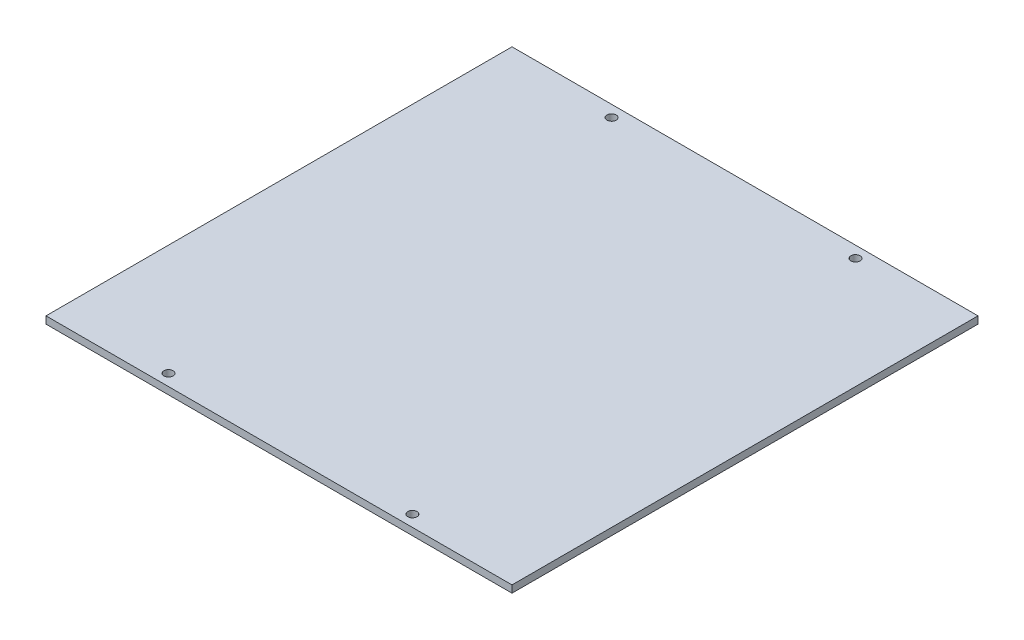
ISO-10303-21;
HEADER;
FILE_DESCRIPTION(('STEP AP214'),'2;1');
FILE_NAME('part.step','',(''),(''),'','','');
FILE_SCHEMA(('AUTOMOTIVE_DESIGN { 1 0 10303 214 1 1 1 1 }'));
ENDSEC;
DATA;
#1=APPLICATION_CONTEXT('core data for automotive mechanical design processes');
#2=APPLICATION_PROTOCOL_DEFINITION('international standard','automotive_design',2000,#1);
#3=PRODUCT_CONTEXT('',#1,'mechanical');
#4=PRODUCT('Part','Part','',(#3));
#5=PRODUCT_RELATED_PRODUCT_CATEGORY('part','',(#4));
#6=PRODUCT_DEFINITION_FORMATION('','',#4);
#7=PRODUCT_DEFINITION_CONTEXT('part definition',#1,'design');
#8=PRODUCT_DEFINITION('design','',#6,#7);
#9=PRODUCT_DEFINITION_SHAPE('','',#8);
#10=(LENGTH_UNIT() NAMED_UNIT(*) SI_UNIT(.MILLI.,.METRE.));
#11=(NAMED_UNIT(*) PLANE_ANGLE_UNIT() SI_UNIT($,.RADIAN.));
#12=(NAMED_UNIT(*) SI_UNIT($,.STERADIAN.) SOLID_ANGLE_UNIT());
#13=UNCERTAINTY_MEASURE_WITH_UNIT(LENGTH_MEASURE(1.E-05),#10,'distance_accuracy_value','');
#14=(GEOMETRIC_REPRESENTATION_CONTEXT(3) GLOBAL_UNCERTAINTY_ASSIGNED_CONTEXT((#13)) GLOBAL_UNIT_ASSIGNED_CONTEXT((#10,
#11,#12)) REPRESENTATION_CONTEXT('',''));
#15=CARTESIAN_POINT('',(0.,0.,0.));
#16=DIRECTION('',(0.,0.,1.));
#17=DIRECTION('',(1.,0.,0.));
#18=AXIS2_PLACEMENT_3D('',#15,#16,#17);
#19=CARTESIAN_POINT('',(0.,1.57,0.));
#20=DIRECTION('',(0.,1.,0.));
#21=DIRECTION('',(0.,0.,1.));
#22=AXIS2_PLACEMENT_3D('',#19,#20,#21);
#23=PLANE('',#22);
#24=CARTESIAN_POINT('',(26.5875,1.57,-48.3));
#25=DIRECTION('',(0.,1.,0.));
#26=DIRECTION('',(0.,0.,1.));
#27=AXIS2_PLACEMENT_3D('',#24,#25,#26);
#28=CIRCLE('',#27,1.);
#29=CARTESIAN_POINT('',(26.5875,1.57,-47.3));
#30=VERTEX_POINT('',#29);
#31=EDGE_CURVE('E123',#30,#30,#28,.T.);
#32=ORIENTED_EDGE('',*,*,#31,.F.);
#33=EDGE_LOOP('',(#32));
#34=FACE_BOUND('',#33,.T.);
#35=CARTESIAN_POINT('',(-26.5875,1.57,48.3));
#36=DIRECTION('',(0.,1.,0.));
#37=DIRECTION('',(0.,0.,1.));
#38=AXIS2_PLACEMENT_3D('',#35,#36,#37);
#39=CIRCLE('',#38,1.);
#40=CARTESIAN_POINT('',(-26.5875,1.57,49.3));
#41=VERTEX_POINT('',#40);
#42=EDGE_CURVE('E102',#41,#41,#39,.T.);
#43=ORIENTED_EDGE('',*,*,#42,.F.);
#44=EDGE_LOOP('',(#43));
#45=FACE_BOUND('',#44,.T.);
#46=DIRECTION('',(0.,0.,1.));
#47=VECTOR('',#46,1.);
#48=CARTESIAN_POINT('',(-50.8,1.57,50.8));
#49=LINE('',#48,#47);
#50=CARTESIAN_POINT('',(-50.8,1.57,-50.8));
#51=VERTEX_POINT('',#50);
#52=CARTESIAN_POINT('',(-50.8,1.57,50.8));
#53=VERTEX_POINT('',#52);
#54=EDGE_CURVE('E87',#51,#53,#49,.T.);
#55=ORIENTED_EDGE('',*,*,#54,.T.);
#56=DIRECTION('',(1.,0.,0.));
#57=VECTOR('',#56,1.);
#58=CARTESIAN_POINT('',(50.8,1.57,50.8));
#59=LINE('',#58,#57);
#60=CARTESIAN_POINT('',(50.8,1.57,50.8));
#61=VERTEX_POINT('',#60);
#62=EDGE_CURVE('E82',#53,#61,#59,.T.);
#63=ORIENTED_EDGE('',*,*,#62,.T.);
#64=DIRECTION('',(0.,0.,-1.));
#65=VECTOR('',#64,1.);
#66=CARTESIAN_POINT('',(50.8,1.57,50.8));
#67=LINE('',#66,#65);
#68=CARTESIAN_POINT('',(50.8,1.57,-50.8));
#69=VERTEX_POINT('',#68);
#70=EDGE_CURVE('E85',#61,#69,#67,.T.);
#71=ORIENTED_EDGE('',*,*,#70,.T.);
#72=DIRECTION('',(-1.,0.,0.));
#73=VECTOR('',#72,1.);
#74=CARTESIAN_POINT('',(50.8,1.57,-50.8));
#75=LINE('',#74,#73);
#76=EDGE_CURVE('E52',#69,#51,#75,.T.);
#77=ORIENTED_EDGE('',*,*,#76,.T.);
#78=EDGE_LOOP('',(#55,#63,#71,#77));
#79=FACE_BOUND('',#78,.T.);
#80=CARTESIAN_POINT('',(-26.5875,1.57,-48.3));
#81=DIRECTION('',(0.,1.,0.));
#82=DIRECTION('',(0.,0.,1.));
#83=AXIS2_PLACEMENT_3D('',#80,#81,#82);
#84=CIRCLE('',#83,1.);
#85=CARTESIAN_POINT('',(-26.5875,1.57,-47.3));
#86=VERTEX_POINT('',#85);
#87=EDGE_CURVE('E117',#86,#86,#84,.T.);
#88=ORIENTED_EDGE('',*,*,#87,.F.);
#89=EDGE_LOOP('',(#88));
#90=FACE_BOUND('',#89,.T.);
#91=CARTESIAN_POINT('',(26.5875,1.57,48.3));
#92=DIRECTION('',(0.,1.,0.));
#93=DIRECTION('',(0.,0.,1.));
#94=AXIS2_PLACEMENT_3D('',#91,#92,#93);
#95=CIRCLE('',#94,1.);
#96=CARTESIAN_POINT('',(26.5875,1.57,49.3));
#97=VERTEX_POINT('',#96);
#98=EDGE_CURVE('E129',#97,#97,#95,.T.);
#99=ORIENTED_EDGE('',*,*,#98,.F.);
#100=EDGE_LOOP('',(#99));
#101=FACE_BOUND('',#100,.T.);
#102=ADVANCED_FACE('F35',(#34,#45,#79,#90,#101),#23,.T.);
#103=CARTESIAN_POINT('',(0.,0.,0.));
#104=DIRECTION('',(0.,1.,0.));
#105=DIRECTION('',(0.,0.,1.));
#106=AXIS2_PLACEMENT_3D('',#103,#104,#105);
#107=PLANE('',#106);
#108=DIRECTION('',(0.,0.,1.));
#109=VECTOR('',#108,1.);
#110=CARTESIAN_POINT('',(-50.8,0.,50.8));
#111=LINE('',#110,#109);
#112=CARTESIAN_POINT('',(-50.8,0.,-50.8));
#113=VERTEX_POINT('',#112);
#114=CARTESIAN_POINT('',(-50.8,0.,50.8));
#115=VERTEX_POINT('',#114);
#116=EDGE_CURVE('E99',#113,#115,#111,.T.);
#117=ORIENTED_EDGE('',*,*,#116,.F.);
#118=DIRECTION('',(-1.,0.,0.));
#119=VECTOR('',#118,1.);
#120=CARTESIAN_POINT('',(50.8,0.,-50.8));
#121=LINE('',#120,#119);
#122=CARTESIAN_POINT('',(50.8,0.,-50.8));
#123=VERTEX_POINT('',#122);
#124=EDGE_CURVE('E75',#123,#113,#121,.T.);
#125=ORIENTED_EDGE('',*,*,#124,.F.);
#126=DIRECTION('',(0.,0.,-1.));
#127=VECTOR('',#126,1.);
#128=CARTESIAN_POINT('',(50.8,0.,50.8));
#129=LINE('',#128,#127);
#130=CARTESIAN_POINT('',(50.8,0.,50.8));
#131=VERTEX_POINT('',#130);
#132=EDGE_CURVE('E69',#131,#123,#129,.T.);
#133=ORIENTED_EDGE('',*,*,#132,.F.);
#134=DIRECTION('',(1.,0.,0.));
#135=VECTOR('',#134,1.);
#136=CARTESIAN_POINT('',(50.8,0.,50.8));
#137=LINE('',#136,#135);
#138=EDGE_CURVE('E91',#115,#131,#137,.T.);
#139=ORIENTED_EDGE('',*,*,#138,.F.);
#140=EDGE_LOOP('',(#117,#125,#133,#139));
#141=FACE_BOUND('',#140,.T.);
#142=CARTESIAN_POINT('',(-26.5875,0.,48.3));
#143=DIRECTION('',(0.,1.,0.));
#144=DIRECTION('',(0.,0.,1.));
#145=AXIS2_PLACEMENT_3D('',#142,#143,#144);
#146=CIRCLE('',#145,1.);
#147=CARTESIAN_POINT('',(-26.5875,0.,49.3));
#148=VERTEX_POINT('',#147);
#149=EDGE_CURVE('E114',#148,#148,#146,.T.);
#150=ORIENTED_EDGE('',*,*,#149,.T.);
#151=EDGE_LOOP('',(#150));
#152=FACE_BOUND('',#151,.T.);
#153=CARTESIAN_POINT('',(-26.5875,0.,-48.3));
#154=DIRECTION('',(0.,1.,0.));
#155=DIRECTION('',(0.,0.,1.));
#156=AXIS2_PLACEMENT_3D('',#153,#154,#155);
#157=CIRCLE('',#156,1.);
#158=CARTESIAN_POINT('',(-26.5875,0.,-47.3));
#159=VERTEX_POINT('',#158);
#160=EDGE_CURVE('E120',#159,#159,#157,.T.);
#161=ORIENTED_EDGE('',*,*,#160,.T.);
#162=EDGE_LOOP('',(#161));
#163=FACE_BOUND('',#162,.T.);
#164=CARTESIAN_POINT('',(26.5875,0.,-48.3));
#165=DIRECTION('',(0.,1.,0.));
#166=DIRECTION('',(0.,0.,1.));
#167=AXIS2_PLACEMENT_3D('',#164,#165,#166);
#168=CIRCLE('',#167,1.);
#169=CARTESIAN_POINT('',(26.5875,0.,-47.3));
#170=VERTEX_POINT('',#169);
#171=EDGE_CURVE('E126',#170,#170,#168,.T.);
#172=ORIENTED_EDGE('',*,*,#171,.T.);
#173=EDGE_LOOP('',(#172));
#174=FACE_BOUND('',#173,.T.);
#175=CARTESIAN_POINT('',(26.5875,0.,48.3));
#176=DIRECTION('',(0.,1.,0.));
#177=DIRECTION('',(0.,0.,1.));
#178=AXIS2_PLACEMENT_3D('',#175,#176,#177);
#179=CIRCLE('',#178,1.);
#180=CARTESIAN_POINT('',(26.5875,0.,49.3));
#181=VERTEX_POINT('',#180);
#182=EDGE_CURVE('E132',#181,#181,#179,.T.);
#183=ORIENTED_EDGE('',*,*,#182,.T.);
#184=EDGE_LOOP('',(#183));
#185=FACE_BOUND('',#184,.T.);
#186=ADVANCED_FACE('F110',(#141,#152,#163,#174,#185),#107,.F.);
#187=CARTESIAN_POINT('',(-50.8,1.57,50.8));
#188=DIRECTION('',(1.,0.,0.));
#189=DIRECTION('',(0.,0.,-1.));
#190=AXIS2_PLACEMENT_3D('',#187,#188,#189);
#191=PLANE('',#190);
#192=ORIENTED_EDGE('',*,*,#116,.T.);
#193=DIRECTION('',(0.,-1.,0.));
#194=VECTOR('',#193,1.);
#195=CARTESIAN_POINT('',(-50.8,1.57,50.8));
#196=LINE('',#195,#194);
#197=EDGE_CURVE('E11',#53,#115,#196,.T.);
#198=ORIENTED_EDGE('',*,*,#197,.F.);
#199=ORIENTED_EDGE('',*,*,#54,.F.);
#200=DIRECTION('',(0.,-1.,0.));
#201=VECTOR('',#200,1.);
#202=CARTESIAN_POINT('',(-50.8,1.57,-50.8));
#203=LINE('',#202,#201);
#204=EDGE_CURVE('E95',#51,#113,#203,.T.);
#205=ORIENTED_EDGE('',*,*,#204,.T.);
#206=EDGE_LOOP('',(#192,#198,#199,#205));
#207=FACE_BOUND('',#206,.T.);
#208=ADVANCED_FACE('F37',(#207),#191,.F.);
#209=CARTESIAN_POINT('',(50.8,1.57,50.8));
#210=DIRECTION('',(0.,0.,-1.));
#211=DIRECTION('',(-1.,0.,0.));
#212=AXIS2_PLACEMENT_3D('',#209,#210,#211);
#213=PLANE('',#212);
#214=ORIENTED_EDGE('',*,*,#138,.T.);
#215=DIRECTION('',(0.,-1.,0.));
#216=VECTOR('',#215,1.);
#217=CARTESIAN_POINT('',(50.8,1.57,50.8));
#218=LINE('',#217,#216);
#219=EDGE_CURVE('E44',#61,#131,#218,.T.);
#220=ORIENTED_EDGE('',*,*,#219,.F.);
#221=ORIENTED_EDGE('',*,*,#62,.F.);
#222=ORIENTED_EDGE('',*,*,#197,.T.);
#223=EDGE_LOOP('',(#214,#220,#221,#222));
#224=FACE_BOUND('',#223,.T.);
#225=ADVANCED_FACE('F90',(#224),#213,.F.);
#226=CARTESIAN_POINT('',(50.8,1.57,50.8));
#227=DIRECTION('',(-1.,0.,0.));
#228=DIRECTION('',(0.,0.,1.));
#229=AXIS2_PLACEMENT_3D('',#226,#227,#228);
#230=PLANE('',#229);
#231=ORIENTED_EDGE('',*,*,#132,.T.);
#232=DIRECTION('',(0.,-1.,0.));
#233=VECTOR('',#232,1.);
#234=CARTESIAN_POINT('',(50.8,1.57,-50.8));
#235=LINE('',#234,#233);
#236=EDGE_CURVE('E92',#69,#123,#235,.T.);
#237=ORIENTED_EDGE('',*,*,#236,.F.);
#238=ORIENTED_EDGE('',*,*,#70,.F.);
#239=ORIENTED_EDGE('',*,*,#219,.T.);
#240=EDGE_LOOP('',(#231,#237,#238,#239));
#241=FACE_BOUND('',#240,.T.);
#242=ADVANCED_FACE('F93',(#241),#230,.F.);
#243=CARTESIAN_POINT('',(50.8,1.57,-50.8));
#244=DIRECTION('',(0.,0.,1.));
#245=DIRECTION('',(1.,0.,0.));
#246=AXIS2_PLACEMENT_3D('',#243,#244,#245);
#247=PLANE('',#246);
#248=ORIENTED_EDGE('',*,*,#124,.T.);
#249=ORIENTED_EDGE('',*,*,#204,.F.);
#250=ORIENTED_EDGE('',*,*,#76,.F.);
#251=ORIENTED_EDGE('',*,*,#236,.T.);
#252=EDGE_LOOP('',(#248,#249,#250,#251));
#253=FACE_BOUND('',#252,.T.);
#254=ADVANCED_FACE('F107',(#253),#247,.F.);
#255=CARTESIAN_POINT('',(-26.5875,1.57,48.3));
#256=DIRECTION('',(0.,-1.,0.));
#257=DIRECTION('',(0.,0.,-1.));
#258=AXIS2_PLACEMENT_3D('',#255,#256,#257);
#259=CYLINDRICAL_SURFACE('',#258,1.);
#260=ORIENTED_EDGE('',*,*,#42,.T.);
#261=EDGE_LOOP('',(#260));
#262=FACE_BOUND('',#261,.T.);
#263=ORIENTED_EDGE('',*,*,#149,.F.);
#264=EDGE_LOOP('',(#263));
#265=FACE_BOUND('',#264,.T.);
#266=ADVANCED_FACE('F151',(#262,#265),#259,.F.);
#267=CARTESIAN_POINT('',(-26.5875,1.57,-48.3));
#268=DIRECTION('',(0.,-1.,0.));
#269=DIRECTION('',(0.,0.,-1.));
#270=AXIS2_PLACEMENT_3D('',#267,#268,#269);
#271=CYLINDRICAL_SURFACE('',#270,1.);
#272=ORIENTED_EDGE('',*,*,#87,.T.);
#273=EDGE_LOOP('',(#272));
#274=FACE_BOUND('',#273,.T.);
#275=ORIENTED_EDGE('',*,*,#160,.F.);
#276=EDGE_LOOP('',(#275));
#277=FACE_BOUND('',#276,.T.);
#278=ADVANCED_FACE('F197',(#274,#277),#271,.F.);
#279=CARTESIAN_POINT('',(26.5875,1.57,-48.3));
#280=DIRECTION('',(0.,-1.,0.));
#281=DIRECTION('',(0.,0.,-1.));
#282=AXIS2_PLACEMENT_3D('',#279,#280,#281);
#283=CYLINDRICAL_SURFACE('',#282,1.);
#284=ORIENTED_EDGE('',*,*,#31,.T.);
#285=EDGE_LOOP('',(#284));
#286=FACE_BOUND('',#285,.T.);
#287=ORIENTED_EDGE('',*,*,#171,.F.);
#288=EDGE_LOOP('',(#287));
#289=FACE_BOUND('',#288,.T.);
#290=ADVANCED_FACE('F205',(#286,#289),#283,.F.);
#291=CARTESIAN_POINT('',(26.5875,1.57,48.3));
#292=DIRECTION('',(0.,-1.,0.));
#293=DIRECTION('',(0.,0.,-1.));
#294=AXIS2_PLACEMENT_3D('',#291,#292,#293);
#295=CYLINDRICAL_SURFACE('',#294,1.);
#296=ORIENTED_EDGE('',*,*,#98,.T.);
#297=EDGE_LOOP('',(#296));
#298=FACE_BOUND('',#297,.T.);
#299=ORIENTED_EDGE('',*,*,#182,.F.);
#300=EDGE_LOOP('',(#299));
#301=FACE_BOUND('',#300,.T.);
#302=ADVANCED_FACE('F138',(#298,#301),#295,.F.);
#303=CLOSED_SHELL('',(#102,#186,#208,#225,#242,#254,#266,#278,#290,#302));
#304=MANIFOLD_SOLID_BREP('B2',#303);
#305=ADVANCED_BREP_SHAPE_REPRESENTATION('',(#18,#304),#14);
#306=SHAPE_DEFINITION_REPRESENTATION(#9,#305);
ENDSEC;
END-ISO-10303-21;
